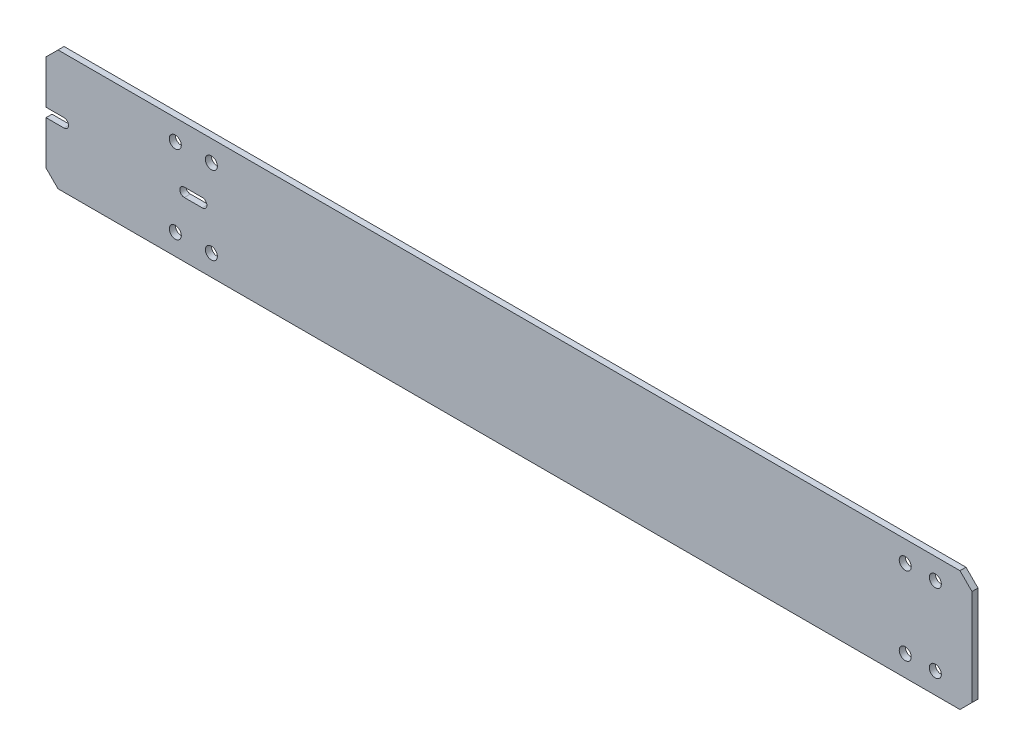
ISO-10303-21;
HEADER;
FILE_DESCRIPTION(('STEP AP214'),'2;1');
FILE_NAME('part.step','',(''),(''),'','','');
FILE_SCHEMA(('AUTOMOTIVE_DESIGN { 1 0 10303 214 1 1 1 1 }'));
ENDSEC;
DATA;
#1=APPLICATION_CONTEXT('core data for automotive mechanical design processes');
#2=APPLICATION_PROTOCOL_DEFINITION('international standard','automotive_design',2000,#1);
#3=PRODUCT_CONTEXT('',#1,'mechanical');
#4=PRODUCT('Part','Part','',(#3));
#5=PRODUCT_RELATED_PRODUCT_CATEGORY('part','',(#4));
#6=PRODUCT_DEFINITION_FORMATION('','',#4);
#7=PRODUCT_DEFINITION_CONTEXT('part definition',#1,'design');
#8=PRODUCT_DEFINITION('design','',#6,#7);
#9=PRODUCT_DEFINITION_SHAPE('','',#8);
#10=(LENGTH_UNIT() NAMED_UNIT(*) SI_UNIT(.MILLI.,.METRE.));
#11=(NAMED_UNIT(*) PLANE_ANGLE_UNIT() SI_UNIT($,.RADIAN.));
#12=(NAMED_UNIT(*) SI_UNIT($,.STERADIAN.) SOLID_ANGLE_UNIT());
#13=UNCERTAINTY_MEASURE_WITH_UNIT(LENGTH_MEASURE(1.E-05),#10,'distance_accuracy_value','');
#14=(GEOMETRIC_REPRESENTATION_CONTEXT(3) GLOBAL_UNCERTAINTY_ASSIGNED_CONTEXT((#13)) GLOBAL_UNIT_ASSIGNED_CONTEXT((#10,
#11,#12)) REPRESENTATION_CONTEXT('',''));
#15=CARTESIAN_POINT('',(0.,0.,0.));
#16=DIRECTION('',(0.,0.,1.));
#17=DIRECTION('',(1.,0.,0.));
#18=AXIS2_PLACEMENT_3D('',#15,#16,#17);
#19=CARTESIAN_POINT('',(-77.,-10.,0.5));
#20=DIRECTION('',(1.,0.,0.));
#21=DIRECTION('',(0.,0.,-1.));
#22=AXIS2_PLACEMENT_3D('',#19,#20,#21);
#23=PLANE('',#22);
#24=DIRECTION('',(0.,-1.,0.));
#25=VECTOR('',#24,1.);
#26=CARTESIAN_POINT('',(-77.,-10.,-0.5));
#27=LINE('',#26,#25);
#28=CARTESIAN_POINT('',(-77.,7.99999999999999,-0.5));
#29=VERTEX_POINT('',#28);
#30=CARTESIAN_POINT('',(-77.,0.75,-0.5));
#31=VERTEX_POINT('',#30);
#32=EDGE_CURVE('E269',#29,#31,#27,.T.);
#33=ORIENTED_EDGE('',*,*,#32,.T.);
#34=DIRECTION('',(0.,0.,-1.));
#35=VECTOR('',#34,1.);
#36=CARTESIAN_POINT('',(-77.,0.75,0.5));
#37=LINE('',#36,#35);
#38=CARTESIAN_POINT('',(-77.,0.75,0.5));
#39=VERTEX_POINT('',#38);
#40=EDGE_CURVE('E200',#39,#31,#37,.T.);
#41=ORIENTED_EDGE('',*,*,#40,.F.);
#42=DIRECTION('',(0.,-1.,0.));
#43=VECTOR('',#42,1.);
#44=CARTESIAN_POINT('',(-77.,-10.,0.5));
#45=LINE('',#44,#43);
#46=CARTESIAN_POINT('',(-77.,7.99999999999999,0.5));
#47=VERTEX_POINT('',#46);
#48=EDGE_CURVE('E255',#47,#39,#45,.T.);
#49=ORIENTED_EDGE('',*,*,#48,.F.);
#50=DIRECTION('',(0.,0.,-1.));
#51=VECTOR('',#50,1.);
#52=CARTESIAN_POINT('',(-77.,7.99999999999999,0.5));
#53=LINE('',#52,#51);
#54=EDGE_CURVE('E46',#47,#29,#53,.T.);
#55=ORIENTED_EDGE('',*,*,#54,.T.);
#56=EDGE_LOOP('',(#33,#41,#49,#55));
#57=FACE_BOUND('',#56,.T.);
#58=ADVANCED_FACE('F37',(#57),#23,.F.);
#59=CARTESIAN_POINT('',(-77.,-0.75,0.5));
#60=VERTEX_POINT('',#59);
#61=CARTESIAN_POINT('',(-77.,-7.99999999999998,0.5));
#62=VERTEX_POINT('',#61);
#63=EDGE_CURVE('E259',#60,#62,#45,.T.);
#64=ORIENTED_EDGE('',*,*,#63,.F.);
#65=DIRECTION('',(0.,0.,-1.));
#66=VECTOR('',#65,1.);
#67=CARTESIAN_POINT('',(-77.,-0.75,0.5));
#68=LINE('',#67,#66);
#69=CARTESIAN_POINT('',(-77.,-0.75,-0.5));
#70=VERTEX_POINT('',#69);
#71=EDGE_CURVE('E202',#60,#70,#68,.T.);
#72=ORIENTED_EDGE('',*,*,#71,.T.);
#73=CARTESIAN_POINT('',(-77.,-7.99999999999998,-0.5));
#74=VERTEX_POINT('',#73);
#75=EDGE_CURVE('E252',#70,#74,#27,.T.);
#76=ORIENTED_EDGE('',*,*,#75,.T.);
#77=DIRECTION('',(0.,0.,1.));
#78=VECTOR('',#77,1.);
#79=CARTESIAN_POINT('',(-77.,-7.99999999999998,0.5));
#80=LINE('',#79,#78);
#81=EDGE_CURVE('E11',#74,#62,#80,.T.);
#82=ORIENTED_EDGE('',*,*,#81,.T.);
#83=EDGE_LOOP('',(#64,#72,#76,#82));
#84=FACE_BOUND('',#83,.T.);
#85=ADVANCED_FACE('F362',(#84),#23,.F.);
#86=CARTESIAN_POINT('',(77.,-9.99999999999999,0.5));
#87=DIRECTION('',(0.,1.,0.));
#88=DIRECTION('',(-1.,0.,0.));
#89=AXIS2_PLACEMENT_3D('',#86,#87,#88);
#90=PLANE('',#89);
#91=DIRECTION('',(1.,0.,0.));
#92=VECTOR('',#91,1.);
#93=CARTESIAN_POINT('',(77.,-9.99999999999999,-0.5));
#94=LINE('',#93,#92);
#95=CARTESIAN_POINT('',(-75.,-10.,-0.5));
#96=VERTEX_POINT('',#95);
#97=CARTESIAN_POINT('',(75.,-9.99999999999999,-0.5));
#98=VERTEX_POINT('',#97);
#99=EDGE_CURVE('E272',#96,#98,#94,.T.);
#100=ORIENTED_EDGE('',*,*,#99,.T.);
#101=DIRECTION('',(0.,0.,1.));
#102=VECTOR('',#101,1.);
#103=CARTESIAN_POINT('',(75.,-9.99999999999999,0.5));
#104=LINE('',#103,#102);
#105=CARTESIAN_POINT('',(75.,-9.99999999999999,0.5));
#106=VERTEX_POINT('',#105);
#107=EDGE_CURVE('E297',#98,#106,#104,.T.);
#108=ORIENTED_EDGE('',*,*,#107,.T.);
#109=DIRECTION('',(1.,0.,0.));
#110=VECTOR('',#109,1.);
#111=CARTESIAN_POINT('',(77.,-9.99999999999999,0.5));
#112=LINE('',#111,#110);
#113=CARTESIAN_POINT('',(-75.,-10.,0.5));
#114=VERTEX_POINT('',#113);
#115=EDGE_CURVE('E258',#114,#106,#112,.T.);
#116=ORIENTED_EDGE('',*,*,#115,.F.);
#117=DIRECTION('',(0.,0.,-1.));
#118=VECTOR('',#117,1.);
#119=CARTESIAN_POINT('',(-75.,-10.,0.5));
#120=LINE('',#119,#118);
#121=EDGE_CURVE('E294',#114,#96,#120,.T.);
#122=ORIENTED_EDGE('',*,*,#121,.T.);
#123=EDGE_LOOP('',(#100,#108,#116,#122));
#124=FACE_BOUND('',#123,.T.);
#125=ADVANCED_FACE('F352',(#124),#90,.F.);
#126=CARTESIAN_POINT('',(77.,-9.99999999999999,0.5));
#127=DIRECTION('',(-1.,0.,0.));
#128=DIRECTION('',(0.,0.,1.));
#129=AXIS2_PLACEMENT_3D('',#126,#127,#128);
#130=PLANE('',#129);
#131=DIRECTION('',(0.,1.,0.));
#132=VECTOR('',#131,1.);
#133=CARTESIAN_POINT('',(77.,-9.99999999999999,0.5));
#134=LINE('',#133,#132);
#135=CARTESIAN_POINT('',(77.,-7.99999999999999,0.5));
#136=VERTEX_POINT('',#135);
#137=CARTESIAN_POINT('',(77.,7.99999999999998,0.5));
#138=VERTEX_POINT('',#137);
#139=EDGE_CURVE('E262',#136,#138,#134,.T.);
#140=ORIENTED_EDGE('',*,*,#139,.F.);
#141=DIRECTION('',(0.,0.,-1.));
#142=VECTOR('',#141,1.);
#143=CARTESIAN_POINT('',(77.,-7.99999999999999,0.5));
#144=LINE('',#143,#142);
#145=CARTESIAN_POINT('',(77.,-7.99999999999999,-0.5));
#146=VERTEX_POINT('',#145);
#147=EDGE_CURVE('E282',#136,#146,#144,.T.);
#148=ORIENTED_EDGE('',*,*,#147,.T.);
#149=DIRECTION('',(0.,1.,0.));
#150=VECTOR('',#149,1.);
#151=CARTESIAN_POINT('',(77.,-9.99999999999999,-0.5));
#152=LINE('',#151,#150);
#153=CARTESIAN_POINT('',(77.,7.99999999999998,-0.5));
#154=VERTEX_POINT('',#153);
#155=EDGE_CURVE('E275',#146,#154,#152,.T.);
#156=ORIENTED_EDGE('',*,*,#155,.T.);
#157=DIRECTION('',(0.,0.,1.));
#158=VECTOR('',#157,1.);
#159=CARTESIAN_POINT('',(77.,7.99999999999998,0.5));
#160=LINE('',#159,#158);
#161=EDGE_CURVE('E268',#154,#138,#160,.T.);
#162=ORIENTED_EDGE('',*,*,#161,.T.);
#163=EDGE_LOOP('',(#140,#148,#156,#162));
#164=FACE_BOUND('',#163,.T.);
#165=ADVANCED_FACE('F342',(#164),#130,.F.);
#166=CARTESIAN_POINT('',(77.,10.,0.5));
#167=DIRECTION('',(0.,-1.,0.));
#168=DIRECTION('',(1.,0.,0.));
#169=AXIS2_PLACEMENT_3D('',#166,#167,#168);
#170=PLANE('',#169);
#171=DIRECTION('',(-1.,0.,0.));
#172=VECTOR('',#171,1.);
#173=CARTESIAN_POINT('',(77.,10.,0.5));
#174=LINE('',#173,#172);
#175=CARTESIAN_POINT('',(75.,10.,0.5));
#176=VERTEX_POINT('',#175);
#177=CARTESIAN_POINT('',(-75.,9.99999999999999,0.5));
#178=VERTEX_POINT('',#177);
#179=EDGE_CURVE('E265',#176,#178,#174,.T.);
#180=ORIENTED_EDGE('',*,*,#179,.F.);
#181=DIRECTION('',(0.,0.,-1.));
#182=VECTOR('',#181,1.);
#183=CARTESIAN_POINT('',(75.,10.,0.5));
#184=LINE('',#183,#182);
#185=CARTESIAN_POINT('',(75.,10.,-0.5));
#186=VERTEX_POINT('',#185);
#187=EDGE_CURVE('E309',#176,#186,#184,.T.);
#188=ORIENTED_EDGE('',*,*,#187,.T.);
#189=DIRECTION('',(-1.,0.,0.));
#190=VECTOR('',#189,1.);
#191=CARTESIAN_POINT('',(77.,10.,-0.5));
#192=LINE('',#191,#190);
#193=CARTESIAN_POINT('',(-75.,9.99999999999999,-0.5));
#194=VERTEX_POINT('',#193);
#195=EDGE_CURVE('E278',#186,#194,#192,.T.);
#196=ORIENTED_EDGE('',*,*,#195,.T.);
#197=DIRECTION('',(0.,0.,1.));
#198=VECTOR('',#197,1.);
#199=CARTESIAN_POINT('',(-75.,9.99999999999999,0.5));
#200=LINE('',#199,#198);
#201=EDGE_CURVE('E307',#194,#178,#200,.T.);
#202=ORIENTED_EDGE('',*,*,#201,.T.);
#203=EDGE_LOOP('',(#180,#188,#196,#202));
#204=FACE_BOUND('',#203,.T.);
#205=ADVANCED_FACE('F335',(#204),#170,.F.);
#206=CARTESIAN_POINT('',(0.,0.,0.5));
#207=DIRECTION('',(0.,0.,1.));
#208=DIRECTION('',(1.,0.,0.));
#209=AXIS2_PLACEMENT_3D('',#206,#207,#208);
#210=PLANE('',#209);
#211=CARTESIAN_POINT('',(-51.,0.,0.5));
#212=DIRECTION('',(0.,0.,-1.));
#213=DIRECTION('',(-1.,0.,0.));
#214=AXIS2_PLACEMENT_3D('',#211,#212,#213);
#215=CIRCLE('',#214,0.749999999999999);
#216=CARTESIAN_POINT('',(-51.,0.75,0.5));
#217=VERTEX_POINT('',#216);
#218=CARTESIAN_POINT('',(-51.,-0.75,0.5));
#219=VERTEX_POINT('',#218);
#220=EDGE_CURVE('E196',#217,#219,#215,.T.);
#221=ORIENTED_EDGE('',*,*,#220,.T.);
#222=DIRECTION('',(-1.,0.,0.));
#223=VECTOR('',#222,1.);
#224=CARTESIAN_POINT('',(-51.,-0.75,0.5));
#225=LINE('',#224,#223);
#226=CARTESIAN_POINT('',(-54.,-0.75,0.5));
#227=VERTEX_POINT('',#226);
#228=EDGE_CURVE('E172',#219,#227,#225,.T.);
#229=ORIENTED_EDGE('',*,*,#228,.T.);
#230=CARTESIAN_POINT('',(-54.,0.,0.5));
#231=DIRECTION('',(0.,0.,-1.));
#232=DIRECTION('',(-1.,0.,0.));
#233=AXIS2_PLACEMENT_3D('',#230,#231,#232);
#234=CIRCLE('',#233,0.749999999999999);
#235=CARTESIAN_POINT('',(-54.,0.749999999999999,0.5));
#236=VERTEX_POINT('',#235);
#237=EDGE_CURVE('E53',#227,#236,#234,.T.);
#238=ORIENTED_EDGE('',*,*,#237,.T.);
#239=DIRECTION('',(1.,0.,0.));
#240=VECTOR('',#239,1.);
#241=CARTESIAN_POINT('',(-51.,0.75,0.5));
#242=LINE('',#241,#240);
#243=EDGE_CURVE('E167',#236,#217,#242,.T.);
#244=ORIENTED_EDGE('',*,*,#243,.T.);
#245=EDGE_LOOP('',(#221,#229,#238,#244));
#246=FACE_BOUND('',#245,.T.);
#247=CARTESIAN_POINT('',(-74.,0.,0.5));
#248=DIRECTION('',(0.,0.,-1.));
#249=DIRECTION('',(-1.,0.,0.));
#250=AXIS2_PLACEMENT_3D('',#247,#248,#249);
#251=CIRCLE('',#250,0.749999999999999);
#252=CARTESIAN_POINT('',(-74.,0.75,0.5));
#253=VERTEX_POINT('',#252);
#254=CARTESIAN_POINT('',(-74.,-0.75,0.5));
#255=VERTEX_POINT('',#254);
#256=EDGE_CURVE('E158',#253,#255,#251,.T.);
#257=ORIENTED_EDGE('',*,*,#256,.T.);
#258=DIRECTION('',(-1.,0.,0.));
#259=VECTOR('',#258,1.);
#260=CARTESIAN_POINT('',(-74.,-0.75,0.5));
#261=LINE('',#260,#259);
#262=EDGE_CURVE('E186',#255,#60,#261,.T.);
#263=ORIENTED_EDGE('',*,*,#262,.T.);
#264=ORIENTED_EDGE('',*,*,#63,.T.);
#265=DIRECTION('',(-0.707106781186543,0.707106781186552,0.));
#266=VECTOR('',#265,1.);
#267=CARTESIAN_POINT('',(-42.5000000000005,-42.4999999999999,0.5));
#268=LINE('',#267,#266);
#269=EDGE_CURVE('E301',#62,#114,#268,.F.);
#270=ORIENTED_EDGE('',*,*,#269,.T.);
#271=ORIENTED_EDGE('',*,*,#115,.T.);
#272=DIRECTION('',(-0.70710678118655,-0.707106781186545,0.));
#273=VECTOR('',#272,1.);
#274=CARTESIAN_POINT('',(42.4999999999997,-42.5,0.5));
#275=LINE('',#274,#273);
#276=EDGE_CURVE('E305',#106,#136,#275,.F.);
#277=ORIENTED_EDGE('',*,*,#276,.T.);
#278=ORIENTED_EDGE('',*,*,#139,.T.);
#279=DIRECTION('',(0.707106781186542,-0.707106781186553,0.));
#280=VECTOR('',#279,1.);
#281=CARTESIAN_POINT('',(42.5000000000006,42.4999999999999,0.5));
#282=LINE('',#281,#280);
#283=EDGE_CURVE('E303',#138,#176,#282,.F.);
#284=ORIENTED_EDGE('',*,*,#283,.T.);
#285=ORIENTED_EDGE('',*,*,#179,.T.);
#286=DIRECTION('',(0.707106781186553,0.707106781186542,0.));
#287=VECTOR('',#286,1.);
#288=CARTESIAN_POINT('',(-42.4999999999994,42.5000000000001,0.5));
#289=LINE('',#288,#287);
#290=EDGE_CURVE('E299',#178,#47,#289,.F.);
#291=ORIENTED_EDGE('',*,*,#290,.T.);
#292=ORIENTED_EDGE('',*,*,#48,.T.);
#293=DIRECTION('',(1.,0.,0.));
#294=VECTOR('',#293,1.);
#295=CARTESIAN_POINT('',(-74.,0.75,0.5));
#296=LINE('',#295,#294);
#297=EDGE_CURVE('E189',#39,#253,#296,.T.);
#298=ORIENTED_EDGE('',*,*,#297,.T.);
#299=EDGE_LOOP('',(#257,#263,#264,#270,#271,#277,#278,#284,#285,#291,#292,#298));
#300=FACE_BOUND('',#299,.T.);
#301=CARTESIAN_POINT('',(-49.5,6.5,0.5));
#302=DIRECTION('',(0.,0.,-1.));
#303=DIRECTION('',(-1.,0.,0.));
#304=AXIS2_PLACEMENT_3D('',#301,#302,#303);
#305=CIRCLE('',#304,0.999999999999998);
#306=CARTESIAN_POINT('',(-50.5,6.5,0.5));
#307=VERTEX_POINT('',#306);
#308=EDGE_CURVE('E213',#307,#307,#305,.T.);
#309=ORIENTED_EDGE('',*,*,#308,.T.);
#310=EDGE_LOOP('',(#309));
#311=FACE_BOUND('',#310,.T.);
#312=CARTESIAN_POINT('',(-55.5,-6.5,0.5));
#313=DIRECTION('',(0.,0.,-1.));
#314=DIRECTION('',(1.,0.,0.));
#315=AXIS2_PLACEMENT_3D('',#312,#313,#314);
#316=CIRCLE('',#315,0.999999999999998);
#317=CARTESIAN_POINT('',(-54.5,-6.5,0.5));
#318=VERTEX_POINT('',#317);
#319=EDGE_CURVE('E220',#318,#318,#316,.T.);
#320=ORIENTED_EDGE('',*,*,#319,.T.);
#321=EDGE_LOOP('',(#320));
#322=FACE_BOUND('',#321,.T.);
#323=CARTESIAN_POINT('',(-49.5,-6.5,0.5));
#324=DIRECTION('',(0.,0.,-1.));
#325=DIRECTION('',(1.,0.,0.));
#326=AXIS2_PLACEMENT_3D('',#323,#324,#325);
#327=CIRCLE('',#326,0.999999999999998);
#328=CARTESIAN_POINT('',(-48.5,-6.5,0.5));
#329=VERTEX_POINT('',#328);
#330=EDGE_CURVE('E207',#329,#329,#327,.T.);
#331=ORIENTED_EDGE('',*,*,#330,.T.);
#332=EDGE_LOOP('',(#331));
#333=FACE_BOUND('',#332,.T.);
#334=CARTESIAN_POINT('',(-55.5,6.5,0.5));
#335=DIRECTION('',(0.,0.,-1.));
#336=DIRECTION('',(-1.,0.,0.));
#337=AXIS2_PLACEMENT_3D('',#334,#335,#336);
#338=CIRCLE('',#337,0.999999999999998);
#339=CARTESIAN_POINT('',(-56.5,6.5,0.5));
#340=VERTEX_POINT('',#339);
#341=EDGE_CURVE('E225',#340,#340,#338,.T.);
#342=ORIENTED_EDGE('',*,*,#341,.T.);
#343=EDGE_LOOP('',(#342));
#344=FACE_BOUND('',#343,.T.);
#345=CARTESIAN_POINT('',(70.9,6.5,0.5));
#346=DIRECTION('',(0.,0.,-1.));
#347=DIRECTION('',(1.,0.,0.));
#348=AXIS2_PLACEMENT_3D('',#345,#346,#347);
#349=CIRCLE('',#348,0.999999999999998);
#350=CARTESIAN_POINT('',(71.9,6.5,0.5));
#351=VERTEX_POINT('',#350);
#352=EDGE_CURVE('E244',#351,#351,#349,.T.);
#353=ORIENTED_EDGE('',*,*,#352,.T.);
#354=EDGE_LOOP('',(#353));
#355=FACE_BOUND('',#354,.T.);
#356=CARTESIAN_POINT('',(65.9,-6.5,0.5));
#357=DIRECTION('',(0.,0.,-1.));
#358=DIRECTION('',(-1.,0.,0.));
#359=AXIS2_PLACEMENT_3D('',#356,#357,#358);
#360=CIRCLE('',#359,0.999999999999998);
#361=CARTESIAN_POINT('',(64.9,-6.5,0.5));
#362=VERTEX_POINT('',#361);
#363=EDGE_CURVE('E238',#362,#362,#360,.T.);
#364=ORIENTED_EDGE('',*,*,#363,.T.);
#365=EDGE_LOOP('',(#364));
#366=FACE_BOUND('',#365,.T.);
#367=CARTESIAN_POINT('',(65.9,6.5,0.5));
#368=DIRECTION('',(0.,0.,-1.));
#369=DIRECTION('',(1.,0.,0.));
#370=AXIS2_PLACEMENT_3D('',#367,#368,#369);
#371=CIRCLE('',#370,0.999999999999998);
#372=CARTESIAN_POINT('',(66.9,6.5,0.5));
#373=VERTEX_POINT('',#372);
#374=EDGE_CURVE('E231',#373,#373,#371,.T.);
#375=ORIENTED_EDGE('',*,*,#374,.T.);
#376=EDGE_LOOP('',(#375));
#377=FACE_BOUND('',#376,.T.);
#378=CARTESIAN_POINT('',(70.9,-6.5,0.5));
#379=DIRECTION('',(0.,0.,-1.));
#380=DIRECTION('',(-1.,0.,0.));
#381=AXIS2_PLACEMENT_3D('',#378,#379,#380);
#382=CIRCLE('',#381,0.999999999999998);
#383=CARTESIAN_POINT('',(69.9,-6.5,0.5));
#384=VERTEX_POINT('',#383);
#385=EDGE_CURVE('E249',#384,#384,#382,.T.);
#386=ORIENTED_EDGE('',*,*,#385,.T.);
#387=EDGE_LOOP('',(#386));
#388=FACE_BOUND('',#387,.T.);
#389=ADVANCED_FACE('F330',(#246,#300,#311,#322,#333,#344,#355,#366,#377,#388),#210,.T.);
#390=CARTESIAN_POINT('',(0.,0.,-0.5));
#391=DIRECTION('',(0.,0.,1.));
#392=DIRECTION('',(1.,0.,0.));
#393=AXIS2_PLACEMENT_3D('',#390,#391,#392);
#394=PLANE('',#393);
#395=DIRECTION('',(-1.,0.,0.));
#396=VECTOR('',#395,1.);
#397=CARTESIAN_POINT('',(-51.,-0.75,-0.5));
#398=LINE('',#397,#396);
#399=CARTESIAN_POINT('',(-51.,-0.75,-0.5));
#400=VERTEX_POINT('',#399);
#401=CARTESIAN_POINT('',(-54.,-0.75,-0.5));
#402=VERTEX_POINT('',#401);
#403=EDGE_CURVE('E173',#400,#402,#398,.T.);
#404=ORIENTED_EDGE('',*,*,#403,.F.);
#405=CARTESIAN_POINT('',(-51.,0.,-0.5));
#406=DIRECTION('',(0.,0.,-1.));
#407=DIRECTION('',(-1.,0.,0.));
#408=AXIS2_PLACEMENT_3D('',#405,#406,#407);
#409=CIRCLE('',#408,0.749999999999999);
#410=CARTESIAN_POINT('',(-51.,0.75,-0.5));
#411=VERTEX_POINT('',#410);
#412=EDGE_CURVE('E61',#411,#400,#409,.T.);
#413=ORIENTED_EDGE('',*,*,#412,.F.);
#414=DIRECTION('',(1.,0.,0.));
#415=VECTOR('',#414,1.);
#416=CARTESIAN_POINT('',(-51.,0.75,-0.5));
#417=LINE('',#416,#415);
#418=CARTESIAN_POINT('',(-54.,0.749999999999999,-0.5));
#419=VERTEX_POINT('',#418);
#420=EDGE_CURVE('E165',#419,#411,#417,.T.);
#421=ORIENTED_EDGE('',*,*,#420,.F.);
#422=CARTESIAN_POINT('',(-54.,0.,-0.5));
#423=DIRECTION('',(0.,0.,-1.));
#424=DIRECTION('',(-1.,0.,0.));
#425=AXIS2_PLACEMENT_3D('',#422,#423,#424);
#426=CIRCLE('',#425,0.749999999999999);
#427=EDGE_CURVE('E149',#402,#419,#426,.T.);
#428=ORIENTED_EDGE('',*,*,#427,.F.);
#429=EDGE_LOOP('',(#404,#413,#421,#428));
#430=FACE_BOUND('',#429,.T.);
#431=CARTESIAN_POINT('',(-49.5,6.5,-0.5));
#432=DIRECTION('',(0.,0.,-1.));
#433=DIRECTION('',(-1.,0.,0.));
#434=AXIS2_PLACEMENT_3D('',#431,#432,#433);
#435=CIRCLE('',#434,0.999999999999998);
#436=CARTESIAN_POINT('',(-50.5,6.5,-0.5));
#437=VERTEX_POINT('',#436);
#438=EDGE_CURVE('E217',#437,#437,#435,.T.);
#439=ORIENTED_EDGE('',*,*,#438,.F.);
#440=EDGE_LOOP('',(#439));
#441=FACE_BOUND('',#440,.T.);
#442=CARTESIAN_POINT('',(-55.5,-6.5,-0.5));
#443=DIRECTION('',(0.,0.,-1.));
#444=DIRECTION('',(1.,0.,0.));
#445=AXIS2_PLACEMENT_3D('',#442,#443,#444);
#446=CIRCLE('',#445,0.999999999999998);
#447=CARTESIAN_POINT('',(-54.5,-6.5,-0.5));
#448=VERTEX_POINT('',#447);
#449=EDGE_CURVE('E210',#448,#448,#446,.T.);
#450=ORIENTED_EDGE('',*,*,#449,.F.);
#451=EDGE_LOOP('',(#450));
#452=FACE_BOUND('',#451,.T.);
#453=CARTESIAN_POINT('',(-49.5,-6.5,-0.5));
#454=DIRECTION('',(0.,0.,-1.));
#455=DIRECTION('',(1.,0.,0.));
#456=AXIS2_PLACEMENT_3D('',#453,#454,#455);
#457=CIRCLE('',#456,0.999999999999998);
#458=CARTESIAN_POINT('',(-48.5,-6.5,-0.5));
#459=VERTEX_POINT('',#458);
#460=EDGE_CURVE('E181',#459,#459,#457,.T.);
#461=ORIENTED_EDGE('',*,*,#460,.F.);
#462=EDGE_LOOP('',(#461));
#463=FACE_BOUND('',#462,.T.);
#464=CARTESIAN_POINT('',(-55.5,6.5,-0.5));
#465=DIRECTION('',(0.,0.,-1.));
#466=DIRECTION('',(-1.,0.,0.));
#467=AXIS2_PLACEMENT_3D('',#464,#465,#466);
#468=CIRCLE('',#467,0.999999999999998);
#469=CARTESIAN_POINT('',(-56.5,6.5,-0.5));
#470=VERTEX_POINT('',#469);
#471=EDGE_CURVE('E216',#470,#470,#468,.T.);
#472=ORIENTED_EDGE('',*,*,#471,.F.);
#473=EDGE_LOOP('',(#472));
#474=FACE_BOUND('',#473,.T.);
#475=CARTESIAN_POINT('',(70.9,6.5,-0.5));
#476=DIRECTION('',(0.,0.,-1.));
#477=DIRECTION('',(1.,0.,0.));
#478=AXIS2_PLACEMENT_3D('',#475,#476,#477);
#479=CIRCLE('',#478,0.999999999999998);
#480=CARTESIAN_POINT('',(71.9,6.5,-0.5));
#481=VERTEX_POINT('',#480);
#482=EDGE_CURVE('E228',#481,#481,#479,.T.);
#483=ORIENTED_EDGE('',*,*,#482,.F.);
#484=EDGE_LOOP('',(#483));
#485=FACE_BOUND('',#484,.T.);
#486=CARTESIAN_POINT('',(65.9,-6.5,-0.5));
#487=DIRECTION('',(0.,0.,-1.));
#488=DIRECTION('',(-1.,0.,0.));
#489=AXIS2_PLACEMENT_3D('',#486,#487,#488);
#490=CIRCLE('',#489,0.999999999999998);
#491=CARTESIAN_POINT('',(64.9,-6.5,-0.5));
#492=VERTEX_POINT('',#491);
#493=EDGE_CURVE('E241',#492,#492,#490,.T.);
#494=ORIENTED_EDGE('',*,*,#493,.F.);
#495=EDGE_LOOP('',(#494));
#496=FACE_BOUND('',#495,.T.);
#497=CARTESIAN_POINT('',(65.9,6.5,-0.5));
#498=DIRECTION('',(0.,0.,-1.));
#499=DIRECTION('',(1.,0.,0.));
#500=AXIS2_PLACEMENT_3D('',#497,#498,#499);
#501=CIRCLE('',#500,0.999999999999998);
#502=CARTESIAN_POINT('',(66.9,6.5,-0.5));
#503=VERTEX_POINT('',#502);
#504=EDGE_CURVE('E235',#503,#503,#501,.T.);
#505=ORIENTED_EDGE('',*,*,#504,.F.);
#506=EDGE_LOOP('',(#505));
#507=FACE_BOUND('',#506,.T.);
#508=CARTESIAN_POINT('',(70.9,-6.5,-0.5));
#509=DIRECTION('',(0.,0.,-1.));
#510=DIRECTION('',(-1.,0.,0.));
#511=AXIS2_PLACEMENT_3D('',#508,#509,#510);
#512=CIRCLE('',#511,0.999999999999998);
#513=CARTESIAN_POINT('',(69.9,-6.5,-0.5));
#514=VERTEX_POINT('',#513);
#515=EDGE_CURVE('E234',#514,#514,#512,.T.);
#516=ORIENTED_EDGE('',*,*,#515,.F.);
#517=EDGE_LOOP('',(#516));
#518=FACE_BOUND('',#517,.T.);
#519=DIRECTION('',(-1.,0.,0.));
#520=VECTOR('',#519,1.);
#521=CARTESIAN_POINT('',(-74.,-0.75,-0.5));
#522=LINE('',#521,#520);
#523=CARTESIAN_POINT('',(-74.,-0.75,-0.5));
#524=VERTEX_POINT('',#523);
#525=EDGE_CURVE('E194',#524,#70,#522,.T.);
#526=ORIENTED_EDGE('',*,*,#525,.F.);
#527=CARTESIAN_POINT('',(-74.,0.,-0.5));
#528=DIRECTION('',(0.,0.,-1.));
#529=DIRECTION('',(-1.,0.,0.));
#530=AXIS2_PLACEMENT_3D('',#527,#528,#529);
#531=CIRCLE('',#530,0.749999999999999);
#532=CARTESIAN_POINT('',(-74.,0.75,-0.5));
#533=VERTEX_POINT('',#532);
#534=EDGE_CURVE('E324',#533,#524,#531,.T.);
#535=ORIENTED_EDGE('',*,*,#534,.F.);
#536=DIRECTION('',(1.,0.,0.));
#537=VECTOR('',#536,1.);
#538=CARTESIAN_POINT('',(-74.,0.75,-0.5));
#539=LINE('',#538,#537);
#540=EDGE_CURVE('E190',#31,#533,#539,.T.);
#541=ORIENTED_EDGE('',*,*,#540,.F.);
#542=ORIENTED_EDGE('',*,*,#32,.F.);
#543=DIRECTION('',(-0.707106781186553,-0.707106781186542,0.));
#544=VECTOR('',#543,1.);
#545=CARTESIAN_POINT('',(-77.,7.99999999999999,-0.5));
#546=LINE('',#545,#544);
#547=EDGE_CURVE('E285',#29,#194,#546,.F.);
#548=ORIENTED_EDGE('',*,*,#547,.T.);
#549=ORIENTED_EDGE('',*,*,#195,.F.);
#550=DIRECTION('',(-0.707106781186542,0.707106781186553,0.));
#551=VECTOR('',#550,1.);
#552=CARTESIAN_POINT('',(75.,10.,-0.5));
#553=LINE('',#552,#551);
#554=EDGE_CURVE('E290',#186,#154,#553,.F.);
#555=ORIENTED_EDGE('',*,*,#554,.T.);
#556=ORIENTED_EDGE('',*,*,#155,.F.);
#557=DIRECTION('',(0.70710678118655,0.707106781186545,0.));
#558=VECTOR('',#557,1.);
#559=CARTESIAN_POINT('',(77.,-7.99999999999999,-0.5));
#560=LINE('',#559,#558);
#561=EDGE_CURVE('E292',#146,#98,#560,.F.);
#562=ORIENTED_EDGE('',*,*,#561,.T.);
#563=ORIENTED_EDGE('',*,*,#99,.F.);
#564=DIRECTION('',(0.707106781186543,-0.707106781186552,0.));
#565=VECTOR('',#564,1.);
#566=CARTESIAN_POINT('',(-75.,-10.,-0.5));
#567=LINE('',#566,#565);
#568=EDGE_CURVE('E287',#96,#74,#567,.F.);
#569=ORIENTED_EDGE('',*,*,#568,.T.);
#570=ORIENTED_EDGE('',*,*,#75,.F.);
#571=EDGE_LOOP('',(#526,#535,#541,#542,#548,#549,#555,#556,#562,#563,#569,#570));
#572=FACE_BOUND('',#571,.T.);
#573=ADVANCED_FACE('F170',(#430,#441,#452,#463,#474,#485,#496,#507,#518,#572),#394,.F.);
#574=CARTESIAN_POINT('',(77.,-7.99999999999999,0.5));
#575=DIRECTION('',(-0.707106781186545,0.70710678118655,0.));
#576=DIRECTION('',(0.,0.,-1.));
#577=AXIS2_PLACEMENT_3D('',#574,#575,#576);
#578=PLANE('',#577);
#579=ORIENTED_EDGE('',*,*,#276,.F.);
#580=ORIENTED_EDGE('',*,*,#107,.F.);
#581=ORIENTED_EDGE('',*,*,#561,.F.);
#582=ORIENTED_EDGE('',*,*,#147,.F.);
#583=EDGE_LOOP('',(#579,#580,#581,#582));
#584=FACE_BOUND('',#583,.T.);
#585=ADVANCED_FACE('F348',(#584),#578,.F.);
#586=CARTESIAN_POINT('',(75.,10.,0.5));
#587=DIRECTION('',(-0.707106781186553,-0.707106781186542,0.));
#588=DIRECTION('',(0.,0.,-1.));
#589=AXIS2_PLACEMENT_3D('',#586,#587,#588);
#590=PLANE('',#589);
#591=ORIENTED_EDGE('',*,*,#283,.F.);
#592=ORIENTED_EDGE('',*,*,#161,.F.);
#593=ORIENTED_EDGE('',*,*,#554,.F.);
#594=ORIENTED_EDGE('',*,*,#187,.F.);
#595=EDGE_LOOP('',(#591,#592,#593,#594));
#596=FACE_BOUND('',#595,.T.);
#597=ADVANCED_FACE('F345',(#596),#590,.F.);
#598=CARTESIAN_POINT('',(-75.,-10.,0.5));
#599=DIRECTION('',(0.707106781186552,0.707106781186542,0.));
#600=DIRECTION('',(0.,0.,-1.));
#601=AXIS2_PLACEMENT_3D('',#598,#599,#600);
#602=PLANE('',#601);
#603=ORIENTED_EDGE('',*,*,#269,.F.);
#604=ORIENTED_EDGE('',*,*,#81,.F.);
#605=ORIENTED_EDGE('',*,*,#568,.F.);
#606=ORIENTED_EDGE('',*,*,#121,.F.);
#607=EDGE_LOOP('',(#603,#604,#605,#606));
#608=FACE_BOUND('',#607,.T.);
#609=ADVANCED_FACE('F357',(#608),#602,.F.);
#610=CARTESIAN_POINT('',(-77.,7.99999999999999,0.5));
#611=DIRECTION('',(0.707106781186542,-0.707106781186553,0.));
#612=DIRECTION('',(0.,0.,-1.));
#613=AXIS2_PLACEMENT_3D('',#610,#611,#612);
#614=PLANE('',#613);
#615=ORIENTED_EDGE('',*,*,#290,.F.);
#616=ORIENTED_EDGE('',*,*,#201,.F.);
#617=ORIENTED_EDGE('',*,*,#547,.F.);
#618=ORIENTED_EDGE('',*,*,#54,.F.);
#619=EDGE_LOOP('',(#615,#616,#617,#618));
#620=FACE_BOUND('',#619,.T.);
#621=ADVANCED_FACE('F40',(#620),#614,.F.);
#622=CARTESIAN_POINT('',(70.9,-6.5,0.5));
#623=DIRECTION('',(0.,0.,-1.));
#624=DIRECTION('',(-1.,0.,0.));
#625=AXIS2_PLACEMENT_3D('',#622,#623,#624);
#626=CYLINDRICAL_SURFACE('',#625,0.999999999999998);
#627=ORIENTED_EDGE('',*,*,#385,.F.);
#628=EDGE_LOOP('',(#627));
#629=FACE_BOUND('',#628,.T.);
#630=ORIENTED_EDGE('',*,*,#515,.T.);
#631=EDGE_LOOP('',(#630));
#632=FACE_BOUND('',#631,.T.);
#633=ADVANCED_FACE('F411',(#629,#632),#626,.F.);
#634=CARTESIAN_POINT('',(65.9,6.5,0.5));
#635=DIRECTION('',(0.,0.,-1.));
#636=DIRECTION('',(-1.,0.,0.));
#637=AXIS2_PLACEMENT_3D('',#634,#635,#636);
#638=CYLINDRICAL_SURFACE('',#637,0.999999999999998);
#639=ORIENTED_EDGE('',*,*,#374,.F.);
#640=EDGE_LOOP('',(#639));
#641=FACE_BOUND('',#640,.T.);
#642=ORIENTED_EDGE('',*,*,#504,.T.);
#643=EDGE_LOOP('',(#642));
#644=FACE_BOUND('',#643,.T.);
#645=ADVANCED_FACE('F415',(#641,#644),#638,.F.);
#646=CARTESIAN_POINT('',(65.9,-6.5,0.5));
#647=DIRECTION('',(0.,0.,-1.));
#648=DIRECTION('',(-1.,0.,0.));
#649=AXIS2_PLACEMENT_3D('',#646,#647,#648);
#650=CYLINDRICAL_SURFACE('',#649,0.999999999999998);
#651=ORIENTED_EDGE('',*,*,#363,.F.);
#652=EDGE_LOOP('',(#651));
#653=FACE_BOUND('',#652,.T.);
#654=ORIENTED_EDGE('',*,*,#493,.T.);
#655=EDGE_LOOP('',(#654));
#656=FACE_BOUND('',#655,.T.);
#657=ADVANCED_FACE('F421',(#653,#656),#650,.F.);
#658=CARTESIAN_POINT('',(70.9,6.5,0.5));
#659=DIRECTION('',(0.,0.,-1.));
#660=DIRECTION('',(-1.,0.,0.));
#661=AXIS2_PLACEMENT_3D('',#658,#659,#660);
#662=CYLINDRICAL_SURFACE('',#661,0.999999999999998);
#663=ORIENTED_EDGE('',*,*,#352,.F.);
#664=EDGE_LOOP('',(#663));
#665=FACE_BOUND('',#664,.T.);
#666=ORIENTED_EDGE('',*,*,#482,.T.);
#667=EDGE_LOOP('',(#666));
#668=FACE_BOUND('',#667,.T.);
#669=ADVANCED_FACE('F428',(#665,#668),#662,.F.);
#670=CARTESIAN_POINT('',(-55.5,6.5,0.5));
#671=DIRECTION('',(0.,0.,-1.));
#672=DIRECTION('',(-1.,0.,0.));
#673=AXIS2_PLACEMENT_3D('',#670,#671,#672);
#674=CYLINDRICAL_SURFACE('',#673,0.999999999999998);
#675=ORIENTED_EDGE('',*,*,#341,.F.);
#676=EDGE_LOOP('',(#675));
#677=FACE_BOUND('',#676,.T.);
#678=ORIENTED_EDGE('',*,*,#471,.T.);
#679=EDGE_LOOP('',(#678));
#680=FACE_BOUND('',#679,.T.);
#681=ADVANCED_FACE('F522',(#677,#680),#674,.F.);
#682=CARTESIAN_POINT('',(-49.5,-6.5,0.5));
#683=DIRECTION('',(0.,0.,-1.));
#684=DIRECTION('',(-1.,0.,0.));
#685=AXIS2_PLACEMENT_3D('',#682,#683,#684);
#686=CYLINDRICAL_SURFACE('',#685,0.999999999999998);
#687=ORIENTED_EDGE('',*,*,#330,.F.);
#688=EDGE_LOOP('',(#687));
#689=FACE_BOUND('',#688,.T.);
#690=ORIENTED_EDGE('',*,*,#460,.T.);
#691=EDGE_LOOP('',(#690));
#692=FACE_BOUND('',#691,.T.);
#693=ADVANCED_FACE('F518',(#689,#692),#686,.F.);
#694=CARTESIAN_POINT('',(-55.5,-6.5,0.5));
#695=DIRECTION('',(0.,0.,-1.));
#696=DIRECTION('',(-1.,0.,0.));
#697=AXIS2_PLACEMENT_3D('',#694,#695,#696);
#698=CYLINDRICAL_SURFACE('',#697,0.999999999999998);
#699=ORIENTED_EDGE('',*,*,#319,.F.);
#700=EDGE_LOOP('',(#699));
#701=FACE_BOUND('',#700,.T.);
#702=ORIENTED_EDGE('',*,*,#449,.T.);
#703=EDGE_LOOP('',(#702));
#704=FACE_BOUND('',#703,.T.);
#705=ADVANCED_FACE('F521',(#701,#704),#698,.F.);
#706=CARTESIAN_POINT('',(-49.5,6.5,0.5));
#707=DIRECTION('',(0.,0.,-1.));
#708=DIRECTION('',(-1.,0.,0.));
#709=AXIS2_PLACEMENT_3D('',#706,#707,#708);
#710=CYLINDRICAL_SURFACE('',#709,0.999999999999998);
#711=ORIENTED_EDGE('',*,*,#308,.F.);
#712=EDGE_LOOP('',(#711));
#713=FACE_BOUND('',#712,.T.);
#714=ORIENTED_EDGE('',*,*,#438,.T.);
#715=EDGE_LOOP('',(#714));
#716=FACE_BOUND('',#715,.T.);
#717=ADVANCED_FACE('F472',(#713,#716),#710,.F.);
#718=CARTESIAN_POINT('',(-74.,0.75,0.5));
#719=DIRECTION('',(0.,1.,0.));
#720=DIRECTION('',(0.,0.,1.));
#721=AXIS2_PLACEMENT_3D('',#718,#719,#720);
#722=PLANE('',#721);
#723=ORIENTED_EDGE('',*,*,#540,.T.);
#724=DIRECTION('',(0.,0.,-1.));
#725=VECTOR('',#724,1.);
#726=CARTESIAN_POINT('',(-74.,0.75,0.5));
#727=LINE('',#726,#725);
#728=EDGE_CURVE('E177',#253,#533,#727,.T.);
#729=ORIENTED_EDGE('',*,*,#728,.F.);
#730=ORIENTED_EDGE('',*,*,#297,.F.);
#731=ORIENTED_EDGE('',*,*,#40,.T.);
#732=EDGE_LOOP('',(#723,#729,#730,#731));
#733=FACE_BOUND('',#732,.T.);
#734=ADVANCED_FACE('F327',(#733),#722,.F.);
#735=CARTESIAN_POINT('',(-74.,-0.75,0.5));
#736=DIRECTION('',(0.,-1.,0.));
#737=DIRECTION('',(0.,0.,-1.));
#738=AXIS2_PLACEMENT_3D('',#735,#736,#737);
#739=PLANE('',#738);
#740=ORIENTED_EDGE('',*,*,#525,.T.);
#741=ORIENTED_EDGE('',*,*,#71,.F.);
#742=ORIENTED_EDGE('',*,*,#262,.F.);
#743=DIRECTION('',(0.,0.,-1.));
#744=VECTOR('',#743,1.);
#745=CARTESIAN_POINT('',(-74.,-0.75,0.5));
#746=LINE('',#745,#744);
#747=EDGE_CURVE('E193',#255,#524,#746,.T.);
#748=ORIENTED_EDGE('',*,*,#747,.T.);
#749=EDGE_LOOP('',(#740,#741,#742,#748));
#750=FACE_BOUND('',#749,.T.);
#751=ADVANCED_FACE('F365',(#750),#739,.F.);
#752=CARTESIAN_POINT('',(-51.,0.75,0.5));
#753=DIRECTION('',(0.,1.,0.));
#754=DIRECTION('',(0.,0.,1.));
#755=AXIS2_PLACEMENT_3D('',#752,#753,#754);
#756=PLANE('',#755);
#757=ORIENTED_EDGE('',*,*,#420,.T.);
#758=DIRECTION('',(0.,0.,-1.));
#759=VECTOR('',#758,1.);
#760=CARTESIAN_POINT('',(-51.,0.75,0.5));
#761=LINE('',#760,#759);
#762=EDGE_CURVE('E168',#217,#411,#761,.T.);
#763=ORIENTED_EDGE('',*,*,#762,.F.);
#764=ORIENTED_EDGE('',*,*,#243,.F.);
#765=DIRECTION('',(0.,0.,-1.));
#766=VECTOR('',#765,1.);
#767=CARTESIAN_POINT('',(-54.,0.75,0.5));
#768=LINE('',#767,#766);
#769=EDGE_CURVE('E152',#236,#419,#768,.T.);
#770=ORIENTED_EDGE('',*,*,#769,.T.);
#771=EDGE_LOOP('',(#757,#763,#764,#770));
#772=FACE_BOUND('',#771,.T.);
#773=ADVANCED_FACE('F163',(#772),#756,.F.);
#774=CARTESIAN_POINT('',(-51.,-0.75,0.5));
#775=DIRECTION('',(0.,-1.,0.));
#776=DIRECTION('',(0.,0.,-1.));
#777=AXIS2_PLACEMENT_3D('',#774,#775,#776);
#778=PLANE('',#777);
#779=ORIENTED_EDGE('',*,*,#403,.T.);
#780=DIRECTION('',(0.,0.,-1.));
#781=VECTOR('',#780,1.);
#782=CARTESIAN_POINT('',(-54.,-0.75,0.5));
#783=LINE('',#782,#781);
#784=EDGE_CURVE('E153',#227,#402,#783,.T.);
#785=ORIENTED_EDGE('',*,*,#784,.F.);
#786=ORIENTED_EDGE('',*,*,#228,.F.);
#787=DIRECTION('',(0.,0.,-1.));
#788=VECTOR('',#787,1.);
#789=CARTESIAN_POINT('',(-51.,-0.75,0.5));
#790=LINE('',#789,#788);
#791=EDGE_CURVE('E184',#219,#400,#790,.T.);
#792=ORIENTED_EDGE('',*,*,#791,.T.);
#793=EDGE_LOOP('',(#779,#785,#786,#792));
#794=FACE_BOUND('',#793,.T.);
#795=ADVANCED_FACE('F376',(#794),#778,.F.);
#796=CARTESIAN_POINT('',(-54.,0.,0.5));
#797=DIRECTION('',(0.,0.,-1.));
#798=DIRECTION('',(-1.,0.,0.));
#799=AXIS2_PLACEMENT_3D('',#796,#797,#798);
#800=CYLINDRICAL_SURFACE('',#799,0.749999999999999);
#801=ORIENTED_EDGE('',*,*,#237,.F.);
#802=ORIENTED_EDGE('',*,*,#784,.T.);
#803=ORIENTED_EDGE('',*,*,#427,.T.);
#804=ORIENTED_EDGE('',*,*,#769,.F.);
#805=EDGE_LOOP('',(#801,#802,#803,#804));
#806=FACE_BOUND('',#805,.T.);
#807=ADVANCED_FACE('F151',(#806),#800,.F.);
#808=CARTESIAN_POINT('',(-51.,0.,0.5));
#809=DIRECTION('',(0.,0.,-1.));
#810=DIRECTION('',(-1.,0.,0.));
#811=AXIS2_PLACEMENT_3D('',#808,#809,#810);
#812=CYLINDRICAL_SURFACE('',#811,0.749999999999999);
#813=ORIENTED_EDGE('',*,*,#762,.T.);
#814=ORIENTED_EDGE('',*,*,#412,.T.);
#815=ORIENTED_EDGE('',*,*,#791,.F.);
#816=ORIENTED_EDGE('',*,*,#220,.F.);
#817=EDGE_LOOP('',(#813,#814,#815,#816));
#818=FACE_BOUND('',#817,.T.);
#819=ADVANCED_FACE('F377',(#818),#812,.F.);
#820=CARTESIAN_POINT('',(-74.,0.,0.5));
#821=DIRECTION('',(0.,0.,-1.));
#822=DIRECTION('',(-1.,0.,0.));
#823=AXIS2_PLACEMENT_3D('',#820,#821,#822);
#824=CYLINDRICAL_SURFACE('',#823,0.749999999999999);
#825=ORIENTED_EDGE('',*,*,#728,.T.);
#826=ORIENTED_EDGE('',*,*,#534,.T.);
#827=ORIENTED_EDGE('',*,*,#747,.F.);
#828=ORIENTED_EDGE('',*,*,#256,.F.);
#829=EDGE_LOOP('',(#825,#826,#827,#828));
#830=FACE_BOUND('',#829,.T.);
#831=ADVANCED_FACE('F379',(#830),#824,.F.);
#832=CLOSED_SHELL('',(#58,#85,#125,#165,#205,#389,#573,#585,#597,#609,#621,#633,#645,#657,#669,
#681,#693,#705,#717,#734,#751,#773,#795,#807,#819,#831));
#833=MANIFOLD_SOLID_BREP('B2',#832);
#834=ADVANCED_BREP_SHAPE_REPRESENTATION('',(#18,#833),#14);
#835=SHAPE_DEFINITION_REPRESENTATION(#9,#834);
ENDSEC;
END-ISO-10303-21;
